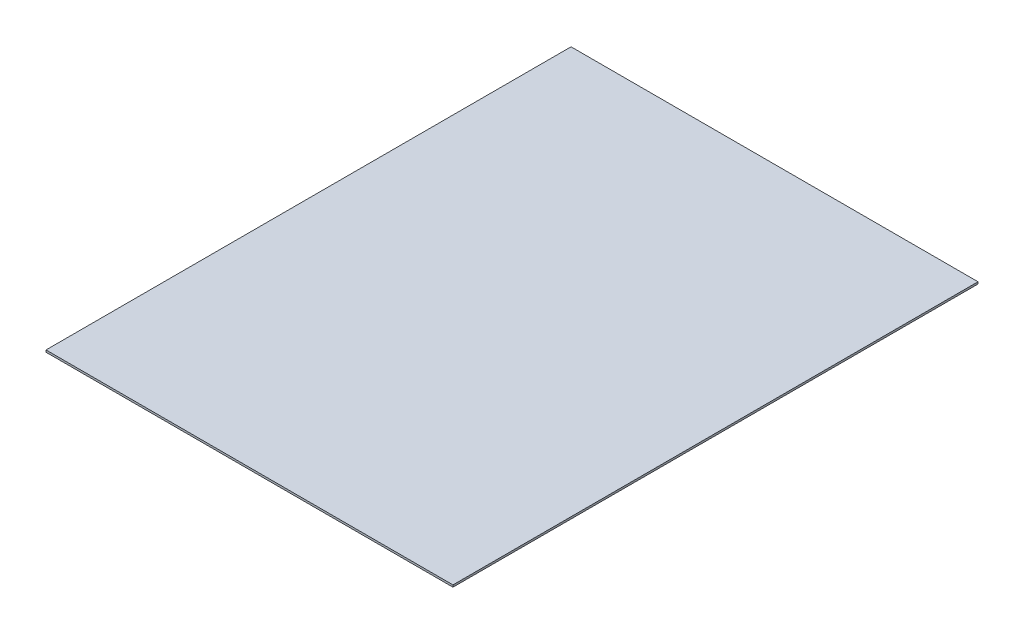
ISO-10303-21;
HEADER;
FILE_DESCRIPTION(('STEP AP214'),'2;1');
FILE_NAME('part.step','',(''),(''),'','','');
FILE_SCHEMA(('AUTOMOTIVE_DESIGN { 1 0 10303 214 1 1 1 1 }'));
ENDSEC;
DATA;
#1=APPLICATION_CONTEXT('core data for automotive mechanical design processes');
#2=APPLICATION_PROTOCOL_DEFINITION('international standard','automotive_design',2000,#1);
#3=PRODUCT_CONTEXT('',#1,'mechanical');
#4=PRODUCT('Part','Part','',(#3));
#5=PRODUCT_RELATED_PRODUCT_CATEGORY('part','',(#4));
#6=PRODUCT_DEFINITION_FORMATION('','',#4);
#7=PRODUCT_DEFINITION_CONTEXT('part definition',#1,'design');
#8=PRODUCT_DEFINITION('design','',#6,#7);
#9=PRODUCT_DEFINITION_SHAPE('','',#8);
#10=(LENGTH_UNIT() NAMED_UNIT(*) SI_UNIT(.MILLI.,.METRE.));
#11=(NAMED_UNIT(*) PLANE_ANGLE_UNIT() SI_UNIT($,.RADIAN.));
#12=(NAMED_UNIT(*) SI_UNIT($,.STERADIAN.) SOLID_ANGLE_UNIT());
#13=UNCERTAINTY_MEASURE_WITH_UNIT(LENGTH_MEASURE(1.E-05),#10,'distance_accuracy_value','');
#14=(GEOMETRIC_REPRESENTATION_CONTEXT(3) GLOBAL_UNCERTAINTY_ASSIGNED_CONTEXT((#13)) GLOBAL_UNIT_ASSIGNED_CONTEXT((#10,
#11,#12)) REPRESENTATION_CONTEXT('',''));
#15=CARTESIAN_POINT('',(0.,0.,0.));
#16=DIRECTION('',(0.,0.,1.));
#17=DIRECTION('',(1.,0.,0.));
#18=AXIS2_PLACEMENT_3D('',#15,#16,#17);
#19=CARTESIAN_POINT('',(563.5625,5.55625,727.075));
#20=DIRECTION('',(-1.,0.,0.));
#21=DIRECTION('',(0.,0.,1.));
#22=AXIS2_PLACEMENT_3D('',#19,#20,#21);
#23=PLANE('',#22);
#24=DIRECTION('',(0.,0.,-1.));
#25=VECTOR('',#24,1.);
#26=CARTESIAN_POINT('',(563.5625,0.,727.075));
#27=LINE('',#26,#25);
#28=CARTESIAN_POINT('',(563.5625,0.,727.075));
#29=VERTEX_POINT('',#28);
#30=CARTESIAN_POINT('',(563.5625,0.,-727.075));
#31=VERTEX_POINT('',#30);
#32=EDGE_CURVE('E102',#29,#31,#27,.T.);
#33=ORIENTED_EDGE('',*,*,#32,.T.);
#34=DIRECTION('',(0.,-1.,0.));
#35=VECTOR('',#34,1.);
#36=CARTESIAN_POINT('',(563.5625,5.55625,-727.075));
#37=LINE('',#36,#35);
#38=CARTESIAN_POINT('',(563.5625,5.55625,-727.075));
#39=VERTEX_POINT('',#38);
#40=EDGE_CURVE('E11',#39,#31,#37,.T.);
#41=ORIENTED_EDGE('',*,*,#40,.F.);
#42=DIRECTION('',(0.,0.,-1.));
#43=VECTOR('',#42,1.);
#44=CARTESIAN_POINT('',(563.5625,5.55625,727.075));
#45=LINE('',#44,#43);
#46=CARTESIAN_POINT('',(563.5625,5.55625,727.075));
#47=VERTEX_POINT('',#46);
#48=EDGE_CURVE('E90',#47,#39,#45,.T.);
#49=ORIENTED_EDGE('',*,*,#48,.F.);
#50=DIRECTION('',(0.,-1.,0.));
#51=VECTOR('',#50,1.);
#52=CARTESIAN_POINT('',(563.5625,5.55625,727.075));
#53=LINE('',#52,#51);
#54=EDGE_CURVE('E98',#47,#29,#53,.T.);
#55=ORIENTED_EDGE('',*,*,#54,.T.);
#56=EDGE_LOOP('',(#33,#41,#49,#55));
#57=FACE_BOUND('',#56,.T.);
#58=ADVANCED_FACE('F39',(#57),#23,.F.);
#59=CARTESIAN_POINT('',(-563.5625,5.55625,-727.075));
#60=DIRECTION('',(0.,0.,1.));
#61=DIRECTION('',(1.,0.,0.));
#62=AXIS2_PLACEMENT_3D('',#59,#60,#61);
#63=PLANE('',#62);
#64=DIRECTION('',(-1.,0.,0.));
#65=VECTOR('',#64,1.);
#66=CARTESIAN_POINT('',(-563.5625,0.,-727.075));
#67=LINE('',#66,#65);
#68=CARTESIAN_POINT('',(-563.5625,0.,-727.075));
#69=VERTEX_POINT('',#68);
#70=EDGE_CURVE('E94',#31,#69,#67,.T.);
#71=ORIENTED_EDGE('',*,*,#70,.T.);
#72=DIRECTION('',(0.,-1.,0.));
#73=VECTOR('',#72,1.);
#74=CARTESIAN_POINT('',(-563.5625,5.55625,-727.075));
#75=LINE('',#74,#73);
#76=CARTESIAN_POINT('',(-563.5625,5.55625,-727.075));
#77=VERTEX_POINT('',#76);
#78=EDGE_CURVE('E47',#77,#69,#75,.T.);
#79=ORIENTED_EDGE('',*,*,#78,.F.);
#80=DIRECTION('',(-1.,0.,0.));
#81=VECTOR('',#80,1.);
#82=CARTESIAN_POINT('',(-563.5625,5.55625,-727.075));
#83=LINE('',#82,#81);
#84=EDGE_CURVE('E85',#39,#77,#83,.T.);
#85=ORIENTED_EDGE('',*,*,#84,.F.);
#86=ORIENTED_EDGE('',*,*,#40,.T.);
#87=EDGE_LOOP('',(#71,#79,#85,#86));
#88=FACE_BOUND('',#87,.T.);
#89=ADVANCED_FACE('F93',(#88),#63,.F.);
#90=CARTESIAN_POINT('',(-563.5625,5.55625,727.075));
#91=DIRECTION('',(1.,0.,0.));
#92=DIRECTION('',(0.,0.,-1.));
#93=AXIS2_PLACEMENT_3D('',#90,#91,#92);
#94=PLANE('',#93);
#95=DIRECTION('',(0.,0.,1.));
#96=VECTOR('',#95,1.);
#97=CARTESIAN_POINT('',(-563.5625,0.,727.075));
#98=LINE('',#97,#96);
#99=CARTESIAN_POINT('',(-563.5625,0.,727.075));
#100=VERTEX_POINT('',#99);
#101=EDGE_CURVE('E72',#69,#100,#98,.T.);
#102=ORIENTED_EDGE('',*,*,#101,.T.);
#103=DIRECTION('',(0.,-1.,0.));
#104=VECTOR('',#103,1.);
#105=CARTESIAN_POINT('',(-563.5625,5.55625,727.075));
#106=LINE('',#105,#104);
#107=CARTESIAN_POINT('',(-563.5625,5.55625,727.075));
#108=VERTEX_POINT('',#107);
#109=EDGE_CURVE('E95',#108,#100,#106,.T.);
#110=ORIENTED_EDGE('',*,*,#109,.F.);
#111=DIRECTION('',(0.,0.,1.));
#112=VECTOR('',#111,1.);
#113=CARTESIAN_POINT('',(-563.5625,5.55625,727.075));
#114=LINE('',#113,#112);
#115=EDGE_CURVE('E88',#77,#108,#114,.T.);
#116=ORIENTED_EDGE('',*,*,#115,.F.);
#117=ORIENTED_EDGE('',*,*,#78,.T.);
#118=EDGE_LOOP('',(#102,#110,#116,#117));
#119=FACE_BOUND('',#118,.T.);
#120=ADVANCED_FACE('F96',(#119),#94,.F.);
#121=CARTESIAN_POINT('',(-563.5625,5.55625,727.075));
#122=DIRECTION('',(0.,0.,-1.));
#123=DIRECTION('',(-1.,0.,0.));
#124=AXIS2_PLACEMENT_3D('',#121,#122,#123);
#125=PLANE('',#124);
#126=DIRECTION('',(1.,0.,0.));
#127=VECTOR('',#126,1.);
#128=CARTESIAN_POINT('',(-563.5625,0.,727.075));
#129=LINE('',#128,#127);
#130=EDGE_CURVE('E78',#100,#29,#129,.T.);
#131=ORIENTED_EDGE('',*,*,#130,.T.);
#132=ORIENTED_EDGE('',*,*,#54,.F.);
#133=DIRECTION('',(1.,0.,0.));
#134=VECTOR('',#133,1.);
#135=CARTESIAN_POINT('',(-563.5625,5.55625,727.075));
#136=LINE('',#135,#134);
#137=EDGE_CURVE('E55',#108,#47,#136,.T.);
#138=ORIENTED_EDGE('',*,*,#137,.F.);
#139=ORIENTED_EDGE('',*,*,#109,.T.);
#140=EDGE_LOOP('',(#131,#132,#138,#139));
#141=FACE_BOUND('',#140,.T.);
#142=ADVANCED_FACE('F109',(#141),#125,.F.);
#143=CARTESIAN_POINT('',(0.,5.55625,0.));
#144=DIRECTION('',(0.,-1.,0.));
#145=DIRECTION('',(0.,0.,-1.));
#146=AXIS2_PLACEMENT_3D('',#143,#144,#145);
#147=PLANE('',#146);
#148=ORIENTED_EDGE('',*,*,#48,.T.);
#149=ORIENTED_EDGE('',*,*,#84,.T.);
#150=ORIENTED_EDGE('',*,*,#115,.T.);
#151=ORIENTED_EDGE('',*,*,#137,.T.);
#152=EDGE_LOOP('',(#148,#149,#150,#151));
#153=FACE_BOUND('',#152,.T.);
#154=ADVANCED_FACE('F86',(#153),#147,.F.);
#155=CARTESIAN_POINT('',(0.,0.,0.));
#156=DIRECTION('',(0.,-1.,0.));
#157=DIRECTION('',(0.,0.,-1.));
#158=AXIS2_PLACEMENT_3D('',#155,#156,#157);
#159=PLANE('',#158);
#160=ORIENTED_EDGE('',*,*,#32,.F.);
#161=ORIENTED_EDGE('',*,*,#130,.F.);
#162=ORIENTED_EDGE('',*,*,#101,.F.);
#163=ORIENTED_EDGE('',*,*,#70,.F.);
#164=EDGE_LOOP('',(#160,#161,#162,#163));
#165=FACE_BOUND('',#164,.T.);
#166=ADVANCED_FACE('F112',(#165),#159,.T.);
#167=CLOSED_SHELL('',(#58,#89,#120,#142,#154,#166));
#168=MANIFOLD_SOLID_BREP('B2',#167);
#169=ADVANCED_BREP_SHAPE_REPRESENTATION('',(#18,#168),#14);
#170=SHAPE_DEFINITION_REPRESENTATION(#9,#169);
ENDSEC;
END-ISO-10303-21;
